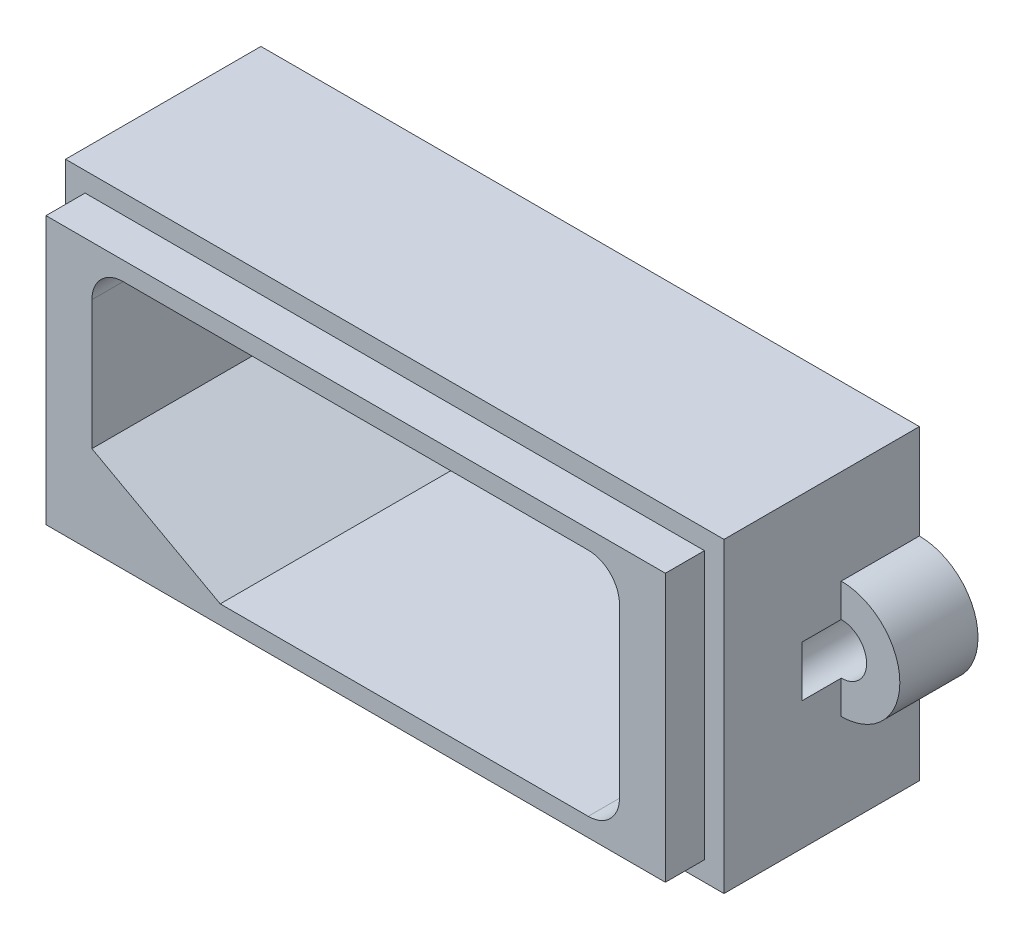
ISO-10303-21;
HEADER;
FILE_DESCRIPTION(('STEP AP214'),'2;1');
FILE_NAME('part.step','',(''),(''),'','','');
FILE_SCHEMA(('AUTOMOTIVE_DESIGN { 1 0 10303 214 1 1 1 1 }'));
ENDSEC;
DATA;
#1=APPLICATION_CONTEXT('core data for automotive mechanical design processes');
#2=APPLICATION_PROTOCOL_DEFINITION('international standard','automotive_design',2000,#1);
#3=PRODUCT_CONTEXT('',#1,'mechanical');
#4=PRODUCT('Part','Part','',(#3));
#5=PRODUCT_RELATED_PRODUCT_CATEGORY('part','',(#4));
#6=PRODUCT_DEFINITION_FORMATION('','',#4);
#7=PRODUCT_DEFINITION_CONTEXT('part definition',#1,'design');
#8=PRODUCT_DEFINITION('design','',#6,#7);
#9=PRODUCT_DEFINITION_SHAPE('','',#8);
#10=(LENGTH_UNIT() NAMED_UNIT(*) SI_UNIT(.MILLI.,.METRE.));
#11=(NAMED_UNIT(*) PLANE_ANGLE_UNIT() SI_UNIT($,.RADIAN.));
#12=(NAMED_UNIT(*) SI_UNIT($,.STERADIAN.) SOLID_ANGLE_UNIT());
#13=UNCERTAINTY_MEASURE_WITH_UNIT(LENGTH_MEASURE(1.E-05),#10,'distance_accuracy_value','');
#14=(GEOMETRIC_REPRESENTATION_CONTEXT(3) GLOBAL_UNCERTAINTY_ASSIGNED_CONTEXT((#13)) GLOBAL_UNIT_ASSIGNED_CONTEXT((#10,
#11,#12)) REPRESENTATION_CONTEXT('',''));
#15=CARTESIAN_POINT('',(0.,0.,0.));
#16=DIRECTION('',(0.,0.,1.));
#17=DIRECTION('',(1.,0.,0.));
#18=AXIS2_PLACEMENT_3D('',#15,#16,#17);
#19=CARTESIAN_POINT('',(0.,0.,178.));
#20=DIRECTION('',(0.,0.,-1.));
#21=DIRECTION('',(-1.,0.,0.));
#22=AXIS2_PLACEMENT_3D('',#19,#20,#21);
#23=PLANE('',#22);
#24=DIRECTION('',(0.,-1.,0.));
#25=VECTOR('',#24,1.);
#26=CARTESIAN_POINT('',(3.49960237165887,-11.624933728609,178.));
#27=LINE('',#26,#25);
#28=CARTESIAN_POINT('',(3.49960237165887,4.07506627139102,178.));
#29=VERTEX_POINT('',#28);
#30=CARTESIAN_POINT('',(3.49960237165887,-11.624933728609,178.));
#31=VERTEX_POINT('',#30);
#32=EDGE_CURVE('E383',#29,#31,#27,.T.);
#33=ORIENTED_EDGE('',*,*,#32,.F.);
#34=DIRECTION('',(1.,0.,0.));
#35=VECTOR('',#34,1.);
#36=CARTESIAN_POINT('',(-30.2003976283411,4.07506627139102,178.));
#37=LINE('',#36,#35);
#38=CARTESIAN_POINT('',(-30.2003976283411,4.07506627139102,178.));
#39=VERTEX_POINT('',#38);
#40=EDGE_CURVE('E427',#39,#29,#37,.T.);
#41=ORIENTED_EDGE('',*,*,#40,.F.);
#42=DIRECTION('',(0.,1.,0.));
#43=VECTOR('',#42,1.);
#44=CARTESIAN_POINT('',(-30.2003976283411,-11.624933728609,178.));
#45=LINE('',#44,#43);
#46=CARTESIAN_POINT('',(-30.2003976283411,-11.624933728609,178.));
#47=VERTEX_POINT('',#46);
#48=EDGE_CURVE('E424',#47,#39,#45,.T.);
#49=ORIENTED_EDGE('',*,*,#48,.F.);
#50=DIRECTION('',(-1.,0.,0.));
#51=VECTOR('',#50,1.);
#52=CARTESIAN_POINT('',(-30.2003976283411,-11.624933728609,178.));
#53=LINE('',#52,#51);
#54=EDGE_CURVE('E421',#31,#47,#53,.T.);
#55=ORIENTED_EDGE('',*,*,#54,.F.);
#56=EDGE_LOOP('',(#33,#41,#49,#55));
#57=FACE_BOUND('',#56,.T.);
#58=DIRECTION('',(0.,1.,0.));
#59=VECTOR('',#58,1.);
#60=CARTESIAN_POINT('',(2.49960237165887,-10.624933728609,178.));
#61=LINE('',#60,#59);
#62=CARTESIAN_POINT('',(2.49960237165887,-10.624933728609,178.));
#63=VERTEX_POINT('',#62);
#64=CARTESIAN_POINT('',(2.49960237165887,3.07506627139103,178.));
#65=VERTEX_POINT('',#64);
#66=EDGE_CURVE('E354',#63,#65,#61,.T.);
#67=ORIENTED_EDGE('',*,*,#66,.F.);
#68=DIRECTION('',(1.,0.,0.));
#69=VECTOR('',#68,1.);
#70=CARTESIAN_POINT('',(-29.2003976283411,-10.624933728609,178.));
#71=LINE('',#70,#69);
#72=CARTESIAN_POINT('',(-29.2003976283411,-10.624933728609,178.));
#73=VERTEX_POINT('',#72);
#74=EDGE_CURVE('E395',#73,#63,#71,.T.);
#75=ORIENTED_EDGE('',*,*,#74,.F.);
#76=DIRECTION('',(0.,-1.,0.));
#77=VECTOR('',#76,1.);
#78=CARTESIAN_POINT('',(-29.2003976283411,-10.624933728609,178.));
#79=LINE('',#78,#77);
#80=CARTESIAN_POINT('',(-29.2003976283411,3.07506627139103,178.));
#81=VERTEX_POINT('',#80);
#82=EDGE_CURVE('E391',#81,#73,#79,.T.);
#83=ORIENTED_EDGE('',*,*,#82,.F.);
#84=DIRECTION('',(-1.,0.,0.));
#85=VECTOR('',#84,1.);
#86=CARTESIAN_POINT('',(-29.2003976283411,3.07506627139103,178.));
#87=LINE('',#86,#85);
#88=EDGE_CURVE('E387',#65,#81,#87,.T.);
#89=ORIENTED_EDGE('',*,*,#88,.F.);
#90=EDGE_LOOP('',(#67,#75,#83,#89));
#91=FACE_BOUND('',#90,.T.);
#92=ADVANCED_FACE('F41',(#57,#91),#23,.F.);
#93=CARTESIAN_POINT('',(3.49960237165887,-11.624933728609,173.));
#94=DIRECTION('',(-1.,0.,0.));
#95=DIRECTION('',(0.,0.,1.));
#96=AXIS2_PLACEMENT_3D('',#93,#94,#95);
#97=PLANE('',#96);
#98=DIRECTION('',(0.,-1.,0.));
#99=VECTOR('',#98,1.);
#100=CARTESIAN_POINT('',(3.49960237165887,-11.624933728609,174.));
#101=LINE('',#100,#99);
#102=CARTESIAN_POINT('',(3.49960237165887,-2.47493372860898,174.));
#103=VERTEX_POINT('',#102);
#104=CARTESIAN_POINT('',(3.49960237165887,-5.07493372860898,174.));
#105=VERTEX_POINT('',#104);
#106=EDGE_CURVE('E11',#103,#105,#101,.T.);
#107=ORIENTED_EDGE('',*,*,#106,.F.);
#108=DIRECTION('',(0.,0.,-1.));
#109=VECTOR('',#108,1.);
#110=CARTESIAN_POINT('',(3.49960237165887,-2.47493372860898,174.));
#111=LINE('',#110,#109);
#112=CARTESIAN_POINT('',(3.49960237165887,-2.47493372860898,172.));
#113=VERTEX_POINT('',#112);
#114=EDGE_CURVE('E232',#103,#113,#111,.T.);
#115=ORIENTED_EDGE('',*,*,#114,.T.);
#116=DIRECTION('',(0.,-1.,0.));
#117=VECTOR('',#116,1.);
#118=CARTESIAN_POINT('',(3.49960237165887,-11.624933728609,172.));
#119=LINE('',#118,#117);
#120=CARTESIAN_POINT('',(3.49960237165887,-0.774933728608975,172.));
#121=VERTEX_POINT('',#120);
#122=EDGE_CURVE('E447',#121,#113,#119,.T.);
#123=ORIENTED_EDGE('',*,*,#122,.F.);
#124=DIRECTION('',(0.,0.,-1.));
#125=VECTOR('',#124,1.);
#126=CARTESIAN_POINT('',(3.49960237165887,-0.774933728608975,172.));
#127=LINE('',#126,#125);
#128=CARTESIAN_POINT('',(3.49960237165887,-0.774933728608975,168.));
#129=VERTEX_POINT('',#128);
#130=EDGE_CURVE('E276',#121,#129,#127,.T.);
#131=ORIENTED_EDGE('',*,*,#130,.T.);
#132=DIRECTION('',(0.,-1.,0.));
#133=VECTOR('',#132,1.);
#134=CARTESIAN_POINT('',(3.49960237165887,4.07506627139102,168.));
#135=LINE('',#134,#133);
#136=CARTESIAN_POINT('',(3.49960237165887,4.07506627139102,168.));
#137=VERTEX_POINT('',#136);
#138=EDGE_CURVE('E311',#137,#129,#135,.T.);
#139=ORIENTED_EDGE('',*,*,#138,.F.);
#140=DIRECTION('',(0.,0.,1.));
#141=VECTOR('',#140,1.);
#142=CARTESIAN_POINT('',(3.49960237165887,4.07506627139102,173.));
#143=LINE('',#142,#141);
#144=EDGE_CURVE('E430',#137,#29,#143,.T.);
#145=ORIENTED_EDGE('',*,*,#144,.T.);
#146=ORIENTED_EDGE('',*,*,#32,.T.);
#147=DIRECTION('',(0.,0.,1.));
#148=VECTOR('',#147,1.);
#149=CARTESIAN_POINT('',(3.49960237165887,-11.624933728609,173.));
#150=LINE('',#149,#148);
#151=CARTESIAN_POINT('',(3.49960237165887,-11.624933728609,168.));
#152=VERTEX_POINT('',#151);
#153=EDGE_CURVE('E442',#152,#31,#150,.T.);
#154=ORIENTED_EDGE('',*,*,#153,.F.);
#155=CARTESIAN_POINT('',(3.49960237165887,-6.77493372860898,168.));
#156=VERTEX_POINT('',#155);
#157=EDGE_CURVE('E310',#156,#152,#135,.T.);
#158=ORIENTED_EDGE('',*,*,#157,.F.);
#159=DIRECTION('',(0.,0.,-1.));
#160=VECTOR('',#159,1.);
#161=CARTESIAN_POINT('',(3.49960237165887,-6.77493372860898,172.));
#162=LINE('',#161,#160);
#163=CARTESIAN_POINT('',(3.49960237165887,-6.77493372860898,172.));
#164=VERTEX_POINT('',#163);
#165=EDGE_CURVE('E270',#156,#164,#162,.F.);
#166=ORIENTED_EDGE('',*,*,#165,.T.);
#167=CARTESIAN_POINT('',(3.49960237165887,-5.07493372860898,172.));
#168=VERTEX_POINT('',#167);
#169=EDGE_CURVE('E446',#168,#164,#119,.T.);
#170=ORIENTED_EDGE('',*,*,#169,.F.);
#171=DIRECTION('',(0.,0.,-1.));
#172=VECTOR('',#171,1.);
#173=CARTESIAN_POINT('',(3.49960237165887,-5.07493372860898,174.));
#174=LINE('',#173,#172);
#175=EDGE_CURVE('E57',#168,#105,#174,.F.);
#176=ORIENTED_EDGE('',*,*,#175,.T.);
#177=EDGE_LOOP('',(#107,#115,#123,#131,#139,#145,#146,#154,#158,#166,#170,#176));
#178=FACE_BOUND('',#177,.T.);
#179=ADVANCED_FACE('F43',(#178),#97,.F.);
#180=CARTESIAN_POINT('',(-30.2003976283411,-11.624933728609,173.));
#181=DIRECTION('',(0.,1.,0.));
#182=DIRECTION('',(0.,0.,1.));
#183=AXIS2_PLACEMENT_3D('',#180,#181,#182);
#184=PLANE('',#183);
#185=ORIENTED_EDGE('',*,*,#54,.T.);
#186=DIRECTION('',(0.,0.,1.));
#187=VECTOR('',#186,1.);
#188=CARTESIAN_POINT('',(-30.2003976283411,-11.624933728609,173.));
#189=LINE('',#188,#187);
#190=CARTESIAN_POINT('',(-30.2003976283411,-11.624933728609,168.));
#191=VERTEX_POINT('',#190);
#192=EDGE_CURVE('E438',#191,#47,#189,.T.);
#193=ORIENTED_EDGE('',*,*,#192,.F.);
#194=DIRECTION('',(-1.,0.,0.));
#195=VECTOR('',#194,1.);
#196=CARTESIAN_POINT('',(3.49960237165887,-11.624933728609,168.));
#197=LINE('',#196,#195);
#198=EDGE_CURVE('E315',#152,#191,#197,.T.);
#199=ORIENTED_EDGE('',*,*,#198,.F.);
#200=ORIENTED_EDGE('',*,*,#153,.T.);
#201=EDGE_LOOP('',(#185,#193,#199,#200));
#202=FACE_BOUND('',#201,.T.);
#203=ADVANCED_FACE('F479',(#202),#184,.F.);
#204=CARTESIAN_POINT('',(-30.2003976283411,-11.624933728609,173.));
#205=DIRECTION('',(1.,0.,0.));
#206=DIRECTION('',(0.,0.,-1.));
#207=AXIS2_PLACEMENT_3D('',#204,#205,#206);
#208=PLANE('',#207);
#209=DIRECTION('',(0.,1.,0.));
#210=VECTOR('',#209,1.);
#211=CARTESIAN_POINT('',(-30.2003976283411,-11.624933728609,174.));
#212=LINE('',#211,#210);
#213=CARTESIAN_POINT('',(-30.2003976283411,-5.07493372860898,174.));
#214=VERTEX_POINT('',#213);
#215=CARTESIAN_POINT('',(-30.2003976283411,-2.47493372860897,174.));
#216=VERTEX_POINT('',#215);
#217=EDGE_CURVE('E50',#214,#216,#212,.T.);
#218=ORIENTED_EDGE('',*,*,#217,.F.);
#219=DIRECTION('',(0.,0.,-1.));
#220=VECTOR('',#219,1.);
#221=CARTESIAN_POINT('',(-30.2003976283411,-5.07493372860898,174.));
#222=LINE('',#221,#220);
#223=CARTESIAN_POINT('',(-30.2003976283411,-5.07493372860898,172.));
#224=VERTEX_POINT('',#223);
#225=EDGE_CURVE('E211',#214,#224,#222,.T.);
#226=ORIENTED_EDGE('',*,*,#225,.T.);
#227=DIRECTION('',(0.,1.,0.));
#228=VECTOR('',#227,1.);
#229=CARTESIAN_POINT('',(-30.2003976283411,-11.624933728609,172.));
#230=LINE('',#229,#228);
#231=CARTESIAN_POINT('',(-30.2003976283411,-6.77493372860898,172.));
#232=VERTEX_POINT('',#231);
#233=EDGE_CURVE('E451',#232,#224,#230,.T.);
#234=ORIENTED_EDGE('',*,*,#233,.F.);
#235=DIRECTION('',(0.,0.,-1.));
#236=VECTOR('',#235,1.);
#237=CARTESIAN_POINT('',(-30.2003976283411,-6.77493372860898,172.));
#238=LINE('',#237,#236);
#239=CARTESIAN_POINT('',(-30.2003976283411,-6.77493372860898,168.));
#240=VERTEX_POINT('',#239);
#241=EDGE_CURVE('E261',#232,#240,#238,.T.);
#242=ORIENTED_EDGE('',*,*,#241,.T.);
#243=DIRECTION('',(0.,1.,0.));
#244=VECTOR('',#243,1.);
#245=CARTESIAN_POINT('',(-30.2003976283411,-11.624933728609,168.));
#246=LINE('',#245,#244);
#247=EDGE_CURVE('E320',#191,#240,#246,.T.);
#248=ORIENTED_EDGE('',*,*,#247,.F.);
#249=ORIENTED_EDGE('',*,*,#192,.T.);
#250=ORIENTED_EDGE('',*,*,#48,.T.);
#251=DIRECTION('',(0.,0.,1.));
#252=VECTOR('',#251,1.);
#253=CARTESIAN_POINT('',(-30.2003976283411,4.07506627139102,173.));
#254=LINE('',#253,#252);
#255=CARTESIAN_POINT('',(-30.2003976283411,4.07506627139102,168.));
#256=VERTEX_POINT('',#255);
#257=EDGE_CURVE('E434',#256,#39,#254,.T.);
#258=ORIENTED_EDGE('',*,*,#257,.F.);
#259=CARTESIAN_POINT('',(-30.2003976283411,-0.774933728608975,168.));
#260=VERTEX_POINT('',#259);
#261=EDGE_CURVE('E319',#260,#256,#246,.T.);
#262=ORIENTED_EDGE('',*,*,#261,.F.);
#263=DIRECTION('',(0.,0.,-1.));
#264=VECTOR('',#263,1.);
#265=CARTESIAN_POINT('',(-30.2003976283411,-0.774933728608975,172.));
#266=LINE('',#265,#264);
#267=CARTESIAN_POINT('',(-30.2003976283411,-0.774933728608975,172.));
#268=VERTEX_POINT('',#267);
#269=EDGE_CURVE('E256',#260,#268,#266,.F.);
#270=ORIENTED_EDGE('',*,*,#269,.T.);
#271=CARTESIAN_POINT('',(-30.2003976283411,-2.47493372860897,172.));
#272=VERTEX_POINT('',#271);
#273=EDGE_CURVE('E219',#272,#268,#230,.T.);
#274=ORIENTED_EDGE('',*,*,#273,.F.);
#275=DIRECTION('',(0.,0.,-1.));
#276=VECTOR('',#275,1.);
#277=CARTESIAN_POINT('',(-30.2003976283411,-2.47493372860897,174.));
#278=LINE('',#277,#276);
#279=EDGE_CURVE('E65',#272,#216,#278,.F.);
#280=ORIENTED_EDGE('',*,*,#279,.T.);
#281=EDGE_LOOP('',(#218,#226,#234,#242,#248,#249,#250,#258,#262,#270,#274,#280));
#282=FACE_BOUND('',#281,.T.);
#283=ADVANCED_FACE('F217',(#282),#208,.F.);
#284=CARTESIAN_POINT('',(-30.2003976283411,4.07506627139102,173.));
#285=DIRECTION('',(0.,-1.,0.));
#286=DIRECTION('',(0.,0.,-1.));
#287=AXIS2_PLACEMENT_3D('',#284,#285,#286);
#288=PLANE('',#287);
#289=ORIENTED_EDGE('',*,*,#40,.T.);
#290=ORIENTED_EDGE('',*,*,#144,.F.);
#291=DIRECTION('',(1.,0.,0.));
#292=VECTOR('',#291,1.);
#293=CARTESIAN_POINT('',(-30.2003976283411,4.07506627139102,168.));
#294=LINE('',#293,#292);
#295=EDGE_CURVE('E306',#256,#137,#294,.T.);
#296=ORIENTED_EDGE('',*,*,#295,.F.);
#297=ORIENTED_EDGE('',*,*,#257,.T.);
#298=EDGE_LOOP('',(#289,#290,#296,#297));
#299=FACE_BOUND('',#298,.T.);
#300=ADVANCED_FACE('F486',(#299),#288,.F.);
#301=CARTESIAN_POINT('',(-29.2003976283411,-10.624933728609,214.533751606218));
#302=DIRECTION('',(0.,1.,0.));
#303=DIRECTION('',(0.,0.,1.));
#304=AXIS2_PLACEMENT_3D('',#301,#302,#303);
#305=PLANE('',#304);
#306=DIRECTION('',(0.,0.,-1.));
#307=VECTOR('',#306,1.);
#308=CARTESIAN_POINT('',(2.49960237165887,-10.624933728609,214.533751606218));
#309=LINE('',#308,#307);
#310=CARTESIAN_POINT('',(2.49960237165887,-10.624933728609,180.));
#311=VERTEX_POINT('',#310);
#312=EDGE_CURVE('E399',#311,#63,#309,.T.);
#313=ORIENTED_EDGE('',*,*,#312,.F.);
#314=DIRECTION('',(-1.,0.,0.));
#315=VECTOR('',#314,1.);
#316=CARTESIAN_POINT('',(-29.2003976283411,-10.624933728609,180.));
#317=LINE('',#316,#315);
#318=CARTESIAN_POINT('',(-29.2003976283411,-10.624933728609,180.));
#319=VERTEX_POINT('',#318);
#320=EDGE_CURVE('E375',#311,#319,#317,.T.);
#321=ORIENTED_EDGE('',*,*,#320,.T.);
#322=DIRECTION('',(0.,0.,-1.));
#323=VECTOR('',#322,1.);
#324=CARTESIAN_POINT('',(-29.2003976283411,-10.624933728609,214.533751606218));
#325=LINE('',#324,#323);
#326=EDGE_CURVE('E403',#319,#73,#325,.T.);
#327=ORIENTED_EDGE('',*,*,#326,.T.);
#328=ORIENTED_EDGE('',*,*,#74,.T.);
#329=EDGE_LOOP('',(#313,#321,#327,#328));
#330=FACE_BOUND('',#329,.T.);
#331=ADVANCED_FACE('F520',(#330),#305,.F.);
#332=CARTESIAN_POINT('',(-29.2003976283411,-10.624933728609,214.533751606218));
#333=DIRECTION('',(1.,0.,0.));
#334=DIRECTION('',(0.,0.,-1.));
#335=AXIS2_PLACEMENT_3D('',#332,#333,#334);
#336=PLANE('',#335);
#337=ORIENTED_EDGE('',*,*,#326,.F.);
#338=DIRECTION('',(0.,1.,0.));
#339=VECTOR('',#338,1.);
#340=CARTESIAN_POINT('',(-29.2003976283411,-10.624933728609,180.));
#341=LINE('',#340,#339);
#342=CARTESIAN_POINT('',(-29.2003976283411,3.07506627139103,180.));
#343=VERTEX_POINT('',#342);
#344=EDGE_CURVE('E370',#319,#343,#341,.T.);
#345=ORIENTED_EDGE('',*,*,#344,.T.);
#346=DIRECTION('',(0.,0.,-1.));
#347=VECTOR('',#346,1.);
#348=CARTESIAN_POINT('',(-29.2003976283411,3.07506627139103,214.533751606218));
#349=LINE('',#348,#347);
#350=EDGE_CURVE('E407',#343,#81,#349,.T.);
#351=ORIENTED_EDGE('',*,*,#350,.T.);
#352=ORIENTED_EDGE('',*,*,#82,.T.);
#353=EDGE_LOOP('',(#337,#345,#351,#352));
#354=FACE_BOUND('',#353,.T.);
#355=ADVANCED_FACE('F544',(#354),#336,.F.);
#356=CARTESIAN_POINT('',(-29.2003976283411,3.07506627139103,214.533751606218));
#357=DIRECTION('',(0.,-1.,0.));
#358=DIRECTION('',(0.,0.,-1.));
#359=AXIS2_PLACEMENT_3D('',#356,#357,#358);
#360=PLANE('',#359);
#361=ORIENTED_EDGE('',*,*,#350,.F.);
#362=DIRECTION('',(1.,0.,0.));
#363=VECTOR('',#362,1.);
#364=CARTESIAN_POINT('',(-29.2003976283411,3.07506627139103,180.));
#365=LINE('',#364,#363);
#366=CARTESIAN_POINT('',(2.49960237165887,3.07506627139103,180.));
#367=VERTEX_POINT('',#366);
#368=EDGE_CURVE('E374',#343,#367,#365,.T.);
#369=ORIENTED_EDGE('',*,*,#368,.T.);
#370=DIRECTION('',(0.,0.,-1.));
#371=VECTOR('',#370,1.);
#372=CARTESIAN_POINT('',(2.49960237165887,3.07506627139103,214.533751606218));
#373=LINE('',#372,#371);
#374=EDGE_CURVE('E411',#367,#65,#373,.T.);
#375=ORIENTED_EDGE('',*,*,#374,.T.);
#376=ORIENTED_EDGE('',*,*,#88,.T.);
#377=EDGE_LOOP('',(#361,#369,#375,#376));
#378=FACE_BOUND('',#377,.T.);
#379=ADVANCED_FACE('F552',(#378),#360,.F.);
#380=CARTESIAN_POINT('',(2.49960237165887,-10.624933728609,214.533751606218));
#381=DIRECTION('',(-1.,0.,0.));
#382=DIRECTION('',(0.,0.,1.));
#383=AXIS2_PLACEMENT_3D('',#380,#381,#382);
#384=PLANE('',#383);
#385=ORIENTED_EDGE('',*,*,#374,.F.);
#386=DIRECTION('',(0.,-1.,0.));
#387=VECTOR('',#386,1.);
#388=CARTESIAN_POINT('',(2.49960237165887,-10.624933728609,180.));
#389=LINE('',#388,#387);
#390=EDGE_CURVE('E379',#367,#311,#389,.T.);
#391=ORIENTED_EDGE('',*,*,#390,.T.);
#392=ORIENTED_EDGE('',*,*,#312,.T.);
#393=ORIENTED_EDGE('',*,*,#66,.T.);
#394=EDGE_LOOP('',(#385,#391,#392,#393));
#395=FACE_BOUND('',#394,.T.);
#396=ADVANCED_FACE('F516',(#395),#384,.F.);
#397=CARTESIAN_POINT('',(-13.3503976283411,19.225066271391,180.));
#398=DIRECTION('',(0.,0.,-1.));
#399=DIRECTION('',(-1.,0.,0.));
#400=AXIS2_PLACEMENT_3D('',#397,#398,#399);
#401=PLANE('',#400);
#402=DIRECTION('',(1.,0.,0.));
#403=VECTOR('',#402,1.);
#404=CARTESIAN_POINT('',(-25.2503976283411,-9.67493372860898,180.));
#405=LINE('',#404,#403);
#406=CARTESIAN_POINT('',(-20.2841282715366,-9.67493372860898,180.));
#407=VERTEX_POINT('',#406);
#408=CARTESIAN_POINT('',(-1.45039762834113,-9.67493372860898,180.));
#409=VERTEX_POINT('',#408);
#410=EDGE_CURVE('E324',#407,#409,#405,.T.);
#411=ORIENTED_EDGE('',*,*,#410,.F.);
#412=DIRECTION('',(-0.877103379862475,0.480301635468612,0.));
#413=VECTOR('',#412,1.);
#414=CARTESIAN_POINT('',(-20.2841282715366,-9.67493372860898,180.));
#415=LINE('',#414,#413);
#416=CARTESIAN_POINT('',(-26.8503976283411,-6.07924594150326,180.));
#417=VERTEX_POINT('',#416);
#418=EDGE_CURVE('E237',#407,#417,#415,.T.);
#419=ORIENTED_EDGE('',*,*,#418,.T.);
#420=DIRECTION('',(0.,-1.,0.));
#421=VECTOR('',#420,1.);
#422=CARTESIAN_POINT('',(-26.8503976283411,0.525066271391011,180.));
#423=LINE('',#422,#421);
#424=CARTESIAN_POINT('',(-26.8503976283411,0.525066271391011,180.));
#425=VERTEX_POINT('',#424);
#426=EDGE_CURVE('E347',#425,#417,#423,.T.);
#427=ORIENTED_EDGE('',*,*,#426,.F.);
#428=CARTESIAN_POINT('',(-25.2503976283411,0.525066271391022,180.));
#429=DIRECTION('',(0.,0.,1.));
#430=DIRECTION('',(1.,0.,0.));
#431=AXIS2_PLACEMENT_3D('',#428,#429,#430);
#432=CIRCLE('',#431,1.6);
#433=CARTESIAN_POINT('',(-25.2503976283411,2.12506627139102,180.));
#434=VERTEX_POINT('',#433);
#435=EDGE_CURVE('E343',#434,#425,#432,.T.);
#436=ORIENTED_EDGE('',*,*,#435,.F.);
#437=DIRECTION('',(-1.,0.,0.));
#438=VECTOR('',#437,1.);
#439=CARTESIAN_POINT('',(-25.2503976283411,2.12506627139102,180.));
#440=LINE('',#439,#438);
#441=CARTESIAN_POINT('',(-1.45039762834113,2.12506627139102,180.));
#442=VERTEX_POINT('',#441);
#443=EDGE_CURVE('E339',#442,#434,#440,.T.);
#444=ORIENTED_EDGE('',*,*,#443,.F.);
#445=CARTESIAN_POINT('',(-1.45039762834112,0.525066271391022,180.));
#446=DIRECTION('',(0.,0.,1.));
#447=DIRECTION('',(-1.,0.,0.));
#448=AXIS2_PLACEMENT_3D('',#445,#446,#447);
#449=CIRCLE('',#448,1.6);
#450=CARTESIAN_POINT('',(0.149602371658878,0.525066271391012,180.));
#451=VERTEX_POINT('',#450);
#452=EDGE_CURVE('E335',#451,#442,#449,.T.);
#453=ORIENTED_EDGE('',*,*,#452,.F.);
#454=DIRECTION('',(0.,1.,0.));
#455=VECTOR('',#454,1.);
#456=CARTESIAN_POINT('',(0.149602371658878,0.525066271391011,180.));
#457=LINE('',#456,#455);
#458=CARTESIAN_POINT('',(0.149602371658879,-8.07493372860897,180.));
#459=VERTEX_POINT('',#458);
#460=EDGE_CURVE('E331',#459,#451,#457,.T.);
#461=ORIENTED_EDGE('',*,*,#460,.F.);
#462=CARTESIAN_POINT('',(-1.45039762834112,-8.07493372860898,180.));
#463=DIRECTION('',(0.,0.,1.));
#464=DIRECTION('',(1.,0.,0.));
#465=AXIS2_PLACEMENT_3D('',#462,#463,#464);
#466=CIRCLE('',#465,1.6);
#467=EDGE_CURVE('E327',#409,#459,#466,.T.);
#468=ORIENTED_EDGE('',*,*,#467,.F.);
#469=EDGE_LOOP('',(#411,#419,#427,#436,#444,#453,#461,#468));
#470=FACE_BOUND('',#469,.T.);
#471=ORIENTED_EDGE('',*,*,#368,.F.);
#472=ORIENTED_EDGE('',*,*,#344,.F.);
#473=ORIENTED_EDGE('',*,*,#320,.F.);
#474=ORIENTED_EDGE('',*,*,#390,.F.);
#475=EDGE_LOOP('',(#471,#472,#473,#474));
#476=FACE_BOUND('',#475,.T.);
#477=ADVANCED_FACE('F565',(#470,#476),#401,.F.);
#478=CARTESIAN_POINT('',(-26.8503976283411,0.525066271391011,170.));
#479=DIRECTION('',(-1.,0.,0.));
#480=DIRECTION('',(0.,0.,1.));
#481=AXIS2_PLACEMENT_3D('',#478,#479,#480);
#482=PLANE('',#481);
#483=ORIENTED_EDGE('',*,*,#426,.T.);
#484=DIRECTION('',(0.,0.,-1.));
#485=VECTOR('',#484,1.);
#486=CARTESIAN_POINT('',(-26.8503976283411,-6.07924594150326,187.486311770722));
#487=LINE('',#486,#485);
#488=CARTESIAN_POINT('',(-26.8503976283411,-6.07924594150326,168.));
#489=VERTEX_POINT('',#488);
#490=EDGE_CURVE('E246',#417,#489,#487,.T.);
#491=ORIENTED_EDGE('',*,*,#490,.T.);
#492=DIRECTION('',(0.,1.,0.));
#493=VECTOR('',#492,1.);
#494=CARTESIAN_POINT('',(-26.8503976283411,-8.07493372860897,168.));
#495=LINE('',#494,#493);
#496=CARTESIAN_POINT('',(-26.8503976283411,0.525066271391011,168.));
#497=VERTEX_POINT('',#496);
#498=EDGE_CURVE('E280',#489,#497,#495,.T.);
#499=ORIENTED_EDGE('',*,*,#498,.T.);
#500=DIRECTION('',(0.,0.,1.));
#501=VECTOR('',#500,1.);
#502=CARTESIAN_POINT('',(-26.8503976283411,0.525066271391011,170.));
#503=LINE('',#502,#501);
#504=EDGE_CURVE('E351',#497,#425,#503,.T.);
#505=ORIENTED_EDGE('',*,*,#504,.T.);
#506=EDGE_LOOP('',(#483,#491,#499,#505));
#507=FACE_BOUND('',#506,.T.);
#508=ADVANCED_FACE('F572',(#507),#482,.F.);
#509=CARTESIAN_POINT('',(-25.2503976283411,0.525066271391022,170.));
#510=DIRECTION('',(0.,0.,1.));
#511=DIRECTION('',(1.,0.,0.));
#512=AXIS2_PLACEMENT_3D('',#509,#510,#511);
#513=CYLINDRICAL_SURFACE('',#512,1.6);
#514=ORIENTED_EDGE('',*,*,#504,.F.);
#515=CARTESIAN_POINT('',(-25.2503976283411,0.525066271391022,168.));
#516=DIRECTION('',(0.,0.,-1.));
#517=DIRECTION('',(-1.,0.,0.));
#518=AXIS2_PLACEMENT_3D('',#515,#516,#517);
#519=CIRCLE('',#518,1.6);
#520=CARTESIAN_POINT('',(-25.2503976283411,2.12506627139102,168.));
#521=VERTEX_POINT('',#520);
#522=EDGE_CURVE('E283',#497,#521,#519,.T.);
#523=ORIENTED_EDGE('',*,*,#522,.T.);
#524=DIRECTION('',(0.,0.,1.));
#525=VECTOR('',#524,1.);
#526=CARTESIAN_POINT('',(-25.2503976283411,2.12506627139102,170.));
#527=LINE('',#526,#525);
#528=EDGE_CURVE('E355',#521,#434,#527,.T.);
#529=ORIENTED_EDGE('',*,*,#528,.T.);
#530=ORIENTED_EDGE('',*,*,#435,.T.);
#531=EDGE_LOOP('',(#514,#523,#529,#530));
#532=FACE_BOUND('',#531,.T.);
#533=ADVANCED_FACE('F581',(#532),#513,.F.);
#534=CARTESIAN_POINT('',(-25.2503976283411,2.12506627139102,170.));
#535=DIRECTION('',(0.,1.,0.));
#536=DIRECTION('',(0.,0.,1.));
#537=AXIS2_PLACEMENT_3D('',#534,#535,#536);
#538=PLANE('',#537);
#539=ORIENTED_EDGE('',*,*,#528,.F.);
#540=DIRECTION('',(1.,0.,0.));
#541=VECTOR('',#540,1.);
#542=CARTESIAN_POINT('',(-25.2503976283411,2.12506627139102,168.));
#543=LINE('',#542,#541);
#544=CARTESIAN_POINT('',(-1.45039762834113,2.12506627139102,168.));
#545=VERTEX_POINT('',#544);
#546=EDGE_CURVE('E287',#521,#545,#543,.T.);
#547=ORIENTED_EDGE('',*,*,#546,.T.);
#548=DIRECTION('',(0.,0.,1.));
#549=VECTOR('',#548,1.);
#550=CARTESIAN_POINT('',(-1.45039762834113,2.12506627139102,170.));
#551=LINE('',#550,#549);
#552=EDGE_CURVE('E358',#545,#442,#551,.T.);
#553=ORIENTED_EDGE('',*,*,#552,.T.);
#554=ORIENTED_EDGE('',*,*,#443,.T.);
#555=EDGE_LOOP('',(#539,#547,#553,#554));
#556=FACE_BOUND('',#555,.T.);
#557=ADVANCED_FACE('F589',(#556),#538,.F.);
#558=CARTESIAN_POINT('',(-1.45039762834112,0.525066271391022,170.));
#559=DIRECTION('',(0.,0.,1.));
#560=DIRECTION('',(1.,0.,0.));
#561=AXIS2_PLACEMENT_3D('',#558,#559,#560);
#562=CYLINDRICAL_SURFACE('',#561,1.6);
#563=ORIENTED_EDGE('',*,*,#552,.F.);
#564=CARTESIAN_POINT('',(-1.45039762834112,0.525066271391022,168.));
#565=DIRECTION('',(0.,0.,-1.));
#566=DIRECTION('',(-1.,0.,0.));
#567=AXIS2_PLACEMENT_3D('',#564,#565,#566);
#568=CIRCLE('',#567,1.6);
#569=CARTESIAN_POINT('',(0.149602371658878,0.525066271391012,168.));
#570=VERTEX_POINT('',#569);
#571=EDGE_CURVE('E291',#545,#570,#568,.T.);
#572=ORIENTED_EDGE('',*,*,#571,.T.);
#573=DIRECTION('',(0.,0.,1.));
#574=VECTOR('',#573,1.);
#575=CARTESIAN_POINT('',(0.149602371658878,0.525066271391012,170.));
#576=LINE('',#575,#574);
#577=EDGE_CURVE('E361',#570,#451,#576,.T.);
#578=ORIENTED_EDGE('',*,*,#577,.T.);
#579=ORIENTED_EDGE('',*,*,#452,.T.);
#580=EDGE_LOOP('',(#563,#572,#578,#579));
#581=FACE_BOUND('',#580,.T.);
#582=ADVANCED_FACE('F597',(#581),#562,.F.);
#583=CARTESIAN_POINT('',(0.149602371658878,0.525066271391011,170.));
#584=DIRECTION('',(1.,0.,0.));
#585=DIRECTION('',(0.,1.,0.));
#586=AXIS2_PLACEMENT_3D('',#583,#584,#585);
#587=PLANE('',#586);
#588=ORIENTED_EDGE('',*,*,#577,.F.);
#589=DIRECTION('',(0.,-1.,0.));
#590=VECTOR('',#589,1.);
#591=CARTESIAN_POINT('',(0.149602371658878,0.525066271391012,168.));
#592=LINE('',#591,#590);
#593=CARTESIAN_POINT('',(0.149602371658879,-8.07493372860897,168.));
#594=VERTEX_POINT('',#593);
#595=EDGE_CURVE('E295',#570,#594,#592,.T.);
#596=ORIENTED_EDGE('',*,*,#595,.T.);
#597=DIRECTION('',(0.,0.,1.));
#598=VECTOR('',#597,1.);
#599=CARTESIAN_POINT('',(0.149602371658879,-8.07493372860897,170.));
#600=LINE('',#599,#598);
#601=EDGE_CURVE('E364',#594,#459,#600,.T.);
#602=ORIENTED_EDGE('',*,*,#601,.T.);
#603=ORIENTED_EDGE('',*,*,#460,.T.);
#604=EDGE_LOOP('',(#588,#596,#602,#603));
#605=FACE_BOUND('',#604,.T.);
#606=ADVANCED_FACE('F605',(#605),#587,.F.);
#607=CARTESIAN_POINT('',(-1.45039762834112,-8.07493372860898,170.));
#608=DIRECTION('',(0.,0.,1.));
#609=DIRECTION('',(1.,0.,0.));
#610=AXIS2_PLACEMENT_3D('',#607,#608,#609);
#611=CYLINDRICAL_SURFACE('',#610,1.6);
#612=ORIENTED_EDGE('',*,*,#601,.F.);
#613=CARTESIAN_POINT('',(-1.45039762834112,-8.07493372860898,168.));
#614=DIRECTION('',(0.,0.,-1.));
#615=DIRECTION('',(-1.,0.,0.));
#616=AXIS2_PLACEMENT_3D('',#613,#614,#615);
#617=CIRCLE('',#616,1.6);
#618=CARTESIAN_POINT('',(-1.45039762834113,-9.67493372860898,168.));
#619=VERTEX_POINT('',#618);
#620=EDGE_CURVE('E299',#594,#619,#617,.T.);
#621=ORIENTED_EDGE('',*,*,#620,.T.);
#622=DIRECTION('',(0.,0.,1.));
#623=VECTOR('',#622,1.);
#624=CARTESIAN_POINT('',(-1.45039762834113,-9.67493372860898,170.));
#625=LINE('',#624,#623);
#626=EDGE_CURVE('E350',#619,#409,#625,.T.);
#627=ORIENTED_EDGE('',*,*,#626,.T.);
#628=ORIENTED_EDGE('',*,*,#467,.T.);
#629=EDGE_LOOP('',(#612,#621,#627,#628));
#630=FACE_BOUND('',#629,.T.);
#631=ADVANCED_FACE('F613',(#630),#611,.F.);
#632=CARTESIAN_POINT('',(-25.2503976283411,-9.67493372860898,170.));
#633=DIRECTION('',(0.,-1.,0.));
#634=DIRECTION('',(0.,0.,-1.));
#635=AXIS2_PLACEMENT_3D('',#632,#633,#634);
#636=PLANE('',#635);
#637=DIRECTION('',(-1.,0.,0.));
#638=VECTOR('',#637,1.);
#639=CARTESIAN_POINT('',(-1.45039762834113,-9.67493372860898,168.));
#640=LINE('',#639,#638);
#641=CARTESIAN_POINT('',(-20.2841282715366,-9.67493372860898,168.));
#642=VERTEX_POINT('',#641);
#643=EDGE_CURVE('E303',#619,#642,#640,.T.);
#644=ORIENTED_EDGE('',*,*,#643,.T.);
#645=DIRECTION('',(0.,0.,-1.));
#646=VECTOR('',#645,1.);
#647=CARTESIAN_POINT('',(-20.2841282715366,-9.67493372860898,187.486311770722));
#648=LINE('',#647,#646);
#649=EDGE_CURVE('E242',#407,#642,#648,.T.);
#650=ORIENTED_EDGE('',*,*,#649,.F.);
#651=ORIENTED_EDGE('',*,*,#410,.T.);
#652=ORIENTED_EDGE('',*,*,#626,.F.);
#653=EDGE_LOOP('',(#644,#650,#651,#652));
#654=FACE_BOUND('',#653,.T.);
#655=ADVANCED_FACE('F621',(#654),#636,.F.);
#656=CARTESIAN_POINT('',(0.,0.,168.));
#657=DIRECTION('',(0.,0.,-1.));
#658=DIRECTION('',(-1.,0.,0.));
#659=AXIS2_PLACEMENT_3D('',#656,#657,#658);
#660=PLANE('',#659);
#661=CARTESIAN_POINT('',(3.49960237165887,-3.77493372860898,168.));
#662=DIRECTION('',(0.,0.,-1.));
#663=DIRECTION('',(-1.,0.,0.));
#664=AXIS2_PLACEMENT_3D('',#661,#662,#663);
#665=CIRCLE('',#664,1.3);
#666=CARTESIAN_POINT('',(2.19960237165887,-3.77493372860898,168.));
#667=VERTEX_POINT('',#666);
#668=EDGE_CURVE('E213',#667,#667,#665,.T.);
#669=ORIENTED_EDGE('',*,*,#668,.F.);
#670=EDGE_LOOP('',(#669));
#671=FACE_BOUND('',#670,.T.);
#672=CARTESIAN_POINT('',(-30.2003976283411,-3.77493372860898,168.));
#673=DIRECTION('',(0.,0.,-1.));
#674=DIRECTION('',(-1.,0.,0.));
#675=AXIS2_PLACEMENT_3D('',#672,#673,#674);
#676=CIRCLE('',#675,1.3);
#677=CARTESIAN_POINT('',(-31.5003976283411,-3.77493372860898,168.));
#678=VERTEX_POINT('',#677);
#679=EDGE_CURVE('E214',#678,#678,#676,.T.);
#680=ORIENTED_EDGE('',*,*,#679,.F.);
#681=EDGE_LOOP('',(#680));
#682=FACE_BOUND('',#681,.T.);
#683=ORIENTED_EDGE('',*,*,#498,.F.);
#684=DIRECTION('',(0.877103379862475,-0.480301635468612,0.));
#685=VECTOR('',#684,1.);
#686=CARTESIAN_POINT('',(-20.2841282715366,-9.67493372860898,168.));
#687=LINE('',#686,#685);
#688=EDGE_CURVE('E236',#489,#642,#687,.T.);
#689=ORIENTED_EDGE('',*,*,#688,.T.);
#690=ORIENTED_EDGE('',*,*,#643,.F.);
#691=ORIENTED_EDGE('',*,*,#620,.F.);
#692=ORIENTED_EDGE('',*,*,#595,.F.);
#693=ORIENTED_EDGE('',*,*,#571,.F.);
#694=ORIENTED_EDGE('',*,*,#546,.F.);
#695=ORIENTED_EDGE('',*,*,#522,.F.);
#696=EDGE_LOOP('',(#683,#689,#690,#691,#692,#693,#694,#695));
#697=FACE_BOUND('',#696,.T.);
#698=ORIENTED_EDGE('',*,*,#247,.T.);
#699=CARTESIAN_POINT('',(-30.2003976283411,-3.77493372860898,168.));
#700=DIRECTION('',(0.,0.,-1.));
#701=DIRECTION('',(-1.,0.,0.));
#702=AXIS2_PLACEMENT_3D('',#699,#700,#701);
#703=CIRCLE('',#702,3.);
#704=EDGE_CURVE('E241',#240,#260,#703,.T.);
#705=ORIENTED_EDGE('',*,*,#704,.T.);
#706=ORIENTED_EDGE('',*,*,#261,.T.);
#707=ORIENTED_EDGE('',*,*,#295,.T.);
#708=ORIENTED_EDGE('',*,*,#138,.T.);
#709=CARTESIAN_POINT('',(3.49960237165887,-3.77493372860898,168.));
#710=DIRECTION('',(0.,0.,-1.));
#711=DIRECTION('',(-1.,0.,0.));
#712=AXIS2_PLACEMENT_3D('',#709,#710,#711);
#713=CIRCLE('',#712,3.);
#714=EDGE_CURVE('E265',#129,#156,#713,.T.);
#715=ORIENTED_EDGE('',*,*,#714,.T.);
#716=ORIENTED_EDGE('',*,*,#157,.T.);
#717=ORIENTED_EDGE('',*,*,#198,.T.);
#718=EDGE_LOOP('',(#698,#705,#706,#707,#708,#715,#716,#717));
#719=FACE_BOUND('',#718,.T.);
#720=ADVANCED_FACE('F474',(#671,#682,#697,#719),#660,.T.);
#721=CARTESIAN_POINT('',(3.49960237165887,-3.77493372860898,172.));
#722=DIRECTION('',(0.,0.,-1.));
#723=DIRECTION('',(-1.,0.,0.));
#724=AXIS2_PLACEMENT_3D('',#721,#722,#723);
#725=PLANE('',#724);
#726=ORIENTED_EDGE('',*,*,#122,.T.);
#727=CARTESIAN_POINT('',(3.49960237165887,-3.77493372860898,172.));
#728=DIRECTION('',(0.,0.,-1.));
#729=DIRECTION('',(-1.,0.,0.));
#730=AXIS2_PLACEMENT_3D('',#727,#728,#729);
#731=CIRCLE('',#730,1.3);
#732=EDGE_CURVE('E209',#113,#168,#731,.T.);
#733=ORIENTED_EDGE('',*,*,#732,.T.);
#734=ORIENTED_EDGE('',*,*,#169,.T.);
#735=CARTESIAN_POINT('',(3.49960237165887,-3.77493372860898,172.));
#736=DIRECTION('',(0.,0.,-1.));
#737=DIRECTION('',(-1.,0.,0.));
#738=AXIS2_PLACEMENT_3D('',#735,#736,#737);
#739=CIRCLE('',#738,3.);
#740=EDGE_CURVE('E266',#121,#164,#739,.T.);
#741=ORIENTED_EDGE('',*,*,#740,.F.);
#742=EDGE_LOOP('',(#726,#733,#734,#741));
#743=FACE_BOUND('',#742,.T.);
#744=ADVANCED_FACE('F461',(#743),#725,.F.);
#745=CARTESIAN_POINT('',(3.49960237165887,-3.77493372860898,172.));
#746=DIRECTION('',(0.,0.,-1.));
#747=DIRECTION('',(-1.,0.,0.));
#748=AXIS2_PLACEMENT_3D('',#745,#746,#747);
#749=CYLINDRICAL_SURFACE('',#748,3.);
#750=ORIENTED_EDGE('',*,*,#130,.F.);
#751=ORIENTED_EDGE('',*,*,#740,.T.);
#752=ORIENTED_EDGE('',*,*,#165,.F.);
#753=ORIENTED_EDGE('',*,*,#714,.F.);
#754=EDGE_LOOP('',(#750,#751,#752,#753));
#755=FACE_BOUND('',#754,.T.);
#756=ADVANCED_FACE('F498',(#755),#749,.T.);
#757=CARTESIAN_POINT('',(-30.2003976283411,-3.77493372860898,172.));
#758=DIRECTION('',(0.,0.,-1.));
#759=DIRECTION('',(-1.,0.,0.));
#760=AXIS2_PLACEMENT_3D('',#757,#758,#759);
#761=PLANE('',#760);
#762=ORIENTED_EDGE('',*,*,#233,.T.);
#763=CARTESIAN_POINT('',(-30.2003976283411,-3.77493372860898,172.));
#764=DIRECTION('',(0.,0.,-1.));
#765=DIRECTION('',(-1.,0.,0.));
#766=AXIS2_PLACEMENT_3D('',#763,#764,#765);
#767=CIRCLE('',#766,1.3);
#768=EDGE_CURVE('E455',#224,#272,#767,.T.);
#769=ORIENTED_EDGE('',*,*,#768,.T.);
#770=ORIENTED_EDGE('',*,*,#273,.T.);
#771=CARTESIAN_POINT('',(-30.2003976283411,-3.77493372860898,172.));
#772=DIRECTION('',(0.,0.,-1.));
#773=DIRECTION('',(-1.,0.,0.));
#774=AXIS2_PLACEMENT_3D('',#771,#772,#773);
#775=CIRCLE('',#774,3.);
#776=EDGE_CURVE('E252',#232,#268,#775,.T.);
#777=ORIENTED_EDGE('',*,*,#776,.F.);
#778=EDGE_LOOP('',(#762,#769,#770,#777));
#779=FACE_BOUND('',#778,.T.);
#780=ADVANCED_FACE('F496',(#779),#761,.F.);
#781=CARTESIAN_POINT('',(-30.2003976283411,-3.77493372860898,172.));
#782=DIRECTION('',(0.,0.,-1.));
#783=DIRECTION('',(-1.,0.,0.));
#784=AXIS2_PLACEMENT_3D('',#781,#782,#783);
#785=CYLINDRICAL_SURFACE('',#784,3.);
#786=ORIENTED_EDGE('',*,*,#241,.F.);
#787=ORIENTED_EDGE('',*,*,#776,.T.);
#788=ORIENTED_EDGE('',*,*,#269,.F.);
#789=ORIENTED_EDGE('',*,*,#704,.F.);
#790=EDGE_LOOP('',(#786,#787,#788,#789));
#791=FACE_BOUND('',#790,.T.);
#792=ADVANCED_FACE('F492',(#791),#785,.T.);
#793=CARTESIAN_POINT('',(-20.2841282715366,-9.67493372860898,187.486311770722));
#794=DIRECTION('',(0.480301635468612,0.877103379862475,0.));
#795=DIRECTION('',(-0.877103379862475,0.480301635468612,0.));
#796=AXIS2_PLACEMENT_3D('',#793,#794,#795);
#797=PLANE('',#796);
#798=ORIENTED_EDGE('',*,*,#418,.F.);
#799=ORIENTED_EDGE('',*,*,#649,.T.);
#800=ORIENTED_EDGE('',*,*,#688,.F.);
#801=ORIENTED_EDGE('',*,*,#490,.F.);
#802=EDGE_LOOP('',(#798,#799,#800,#801));
#803=FACE_BOUND('',#802,.T.);
#804=ADVANCED_FACE('F504',(#803),#797,.T.);
#805=CARTESIAN_POINT('',(-30.2003976283411,-3.77493372860898,174.));
#806=DIRECTION('',(0.,0.,-1.));
#807=DIRECTION('',(-1.,0.,0.));
#808=AXIS2_PLACEMENT_3D('',#805,#806,#807);
#809=PLANE('',#808);
#810=ORIENTED_EDGE('',*,*,#217,.T.);
#811=CARTESIAN_POINT('',(-30.2003976283411,-3.77493372860898,174.));
#812=DIRECTION('',(0.,0.,-1.));
#813=DIRECTION('',(-1.,0.,0.));
#814=AXIS2_PLACEMENT_3D('',#811,#812,#813);
#815=CIRCLE('',#814,1.3);
#816=EDGE_CURVE('E205',#216,#214,#815,.T.);
#817=ORIENTED_EDGE('',*,*,#816,.T.);
#818=EDGE_LOOP('',(#810,#817));
#819=FACE_BOUND('',#818,.T.);
#820=ADVANCED_FACE('F204',(#819),#809,.T.);
#821=CARTESIAN_POINT('',(-30.2003976283411,-3.77493372860898,174.));
#822=DIRECTION('',(0.,0.,-1.));
#823=DIRECTION('',(-1.,0.,0.));
#824=AXIS2_PLACEMENT_3D('',#821,#822,#823);
#825=CYLINDRICAL_SURFACE('',#824,1.3);
#826=ORIENTED_EDGE('',*,*,#679,.T.);
#827=EDGE_LOOP('',(#826));
#828=FACE_BOUND('',#827,.T.);
#829=ORIENTED_EDGE('',*,*,#816,.F.);
#830=ORIENTED_EDGE('',*,*,#279,.F.);
#831=ORIENTED_EDGE('',*,*,#768,.F.);
#832=ORIENTED_EDGE('',*,*,#225,.F.);
#833=EDGE_LOOP('',(#829,#830,#831,#832));
#834=FACE_BOUND('',#833,.T.);
#835=ADVANCED_FACE('F210',(#828,#834),#825,.F.);
#836=CARTESIAN_POINT('',(3.49960237165887,-3.77493372860898,174.));
#837=DIRECTION('',(0.,0.,-1.));
#838=DIRECTION('',(-1.,0.,0.));
#839=AXIS2_PLACEMENT_3D('',#836,#837,#838);
#840=PLANE('',#839);
#841=ORIENTED_EDGE('',*,*,#106,.T.);
#842=CARTESIAN_POINT('',(3.49960237165887,-3.77493372860898,174.));
#843=DIRECTION('',(0.,0.,-1.));
#844=DIRECTION('',(-1.,0.,0.));
#845=AXIS2_PLACEMENT_3D('',#842,#843,#844);
#846=CIRCLE('',#845,1.3);
#847=EDGE_CURVE('E221',#105,#103,#846,.T.);
#848=ORIENTED_EDGE('',*,*,#847,.T.);
#849=EDGE_LOOP('',(#841,#848));
#850=FACE_BOUND('',#849,.T.);
#851=ADVANCED_FACE('F671',(#850),#840,.T.);
#852=CARTESIAN_POINT('',(3.49960237165887,-3.77493372860898,174.));
#853=DIRECTION('',(0.,0.,-1.));
#854=DIRECTION('',(-1.,0.,0.));
#855=AXIS2_PLACEMENT_3D('',#852,#853,#854);
#856=CYLINDRICAL_SURFACE('',#855,1.3);
#857=ORIENTED_EDGE('',*,*,#668,.T.);
#858=EDGE_LOOP('',(#857));
#859=FACE_BOUND('',#858,.T.);
#860=ORIENTED_EDGE('',*,*,#847,.F.);
#861=ORIENTED_EDGE('',*,*,#175,.F.);
#862=ORIENTED_EDGE('',*,*,#732,.F.);
#863=ORIENTED_EDGE('',*,*,#114,.F.);
#864=EDGE_LOOP('',(#860,#861,#862,#863));
#865=FACE_BOUND('',#864,.T.);
#866=ADVANCED_FACE('F679',(#859,#865),#856,.F.);
#867=CLOSED_SHELL('',(#92,#179,#203,#283,#300,#331,#355,#379,#396,#477,#508,#533,#557,#582,#606,
#631,#655,#720,#744,#756,#780,#792,#804,#820,#835,#851,#866));
#868=MANIFOLD_SOLID_BREP('B2',#867);
#869=ADVANCED_BREP_SHAPE_REPRESENTATION('',(#18,#868),#14);
#870=SHAPE_DEFINITION_REPRESENTATION(#9,#869);
ENDSEC;
END-ISO-10303-21;
